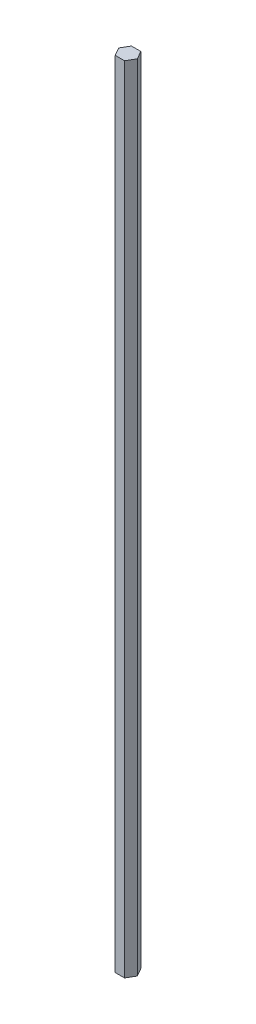
ISO-10303-21;
HEADER;
FILE_DESCRIPTION(('STEP AP214'),'2;1');
FILE_NAME('part.step','',(''),(''),'','','');
FILE_SCHEMA(('AUTOMOTIVE_DESIGN { 1 0 10303 214 1 1 1 1 }'));
ENDSEC;
DATA;
#1=APPLICATION_CONTEXT('core data for automotive mechanical design processes');
#2=APPLICATION_PROTOCOL_DEFINITION('international standard','automotive_design',2000,#1);
#3=PRODUCT_CONTEXT('',#1,'mechanical');
#4=PRODUCT('Part','Part','',(#3));
#5=PRODUCT_RELATED_PRODUCT_CATEGORY('part','',(#4));
#6=PRODUCT_DEFINITION_FORMATION('','',#4);
#7=PRODUCT_DEFINITION_CONTEXT('part definition',#1,'design');
#8=PRODUCT_DEFINITION('design','',#6,#7);
#9=PRODUCT_DEFINITION_SHAPE('','',#8);
#10=(LENGTH_UNIT() NAMED_UNIT(*) SI_UNIT(.MILLI.,.METRE.));
#11=(NAMED_UNIT(*) PLANE_ANGLE_UNIT() SI_UNIT($,.RADIAN.));
#12=(NAMED_UNIT(*) SI_UNIT($,.STERADIAN.) SOLID_ANGLE_UNIT());
#13=UNCERTAINTY_MEASURE_WITH_UNIT(LENGTH_MEASURE(1.E-05),#10,'distance_accuracy_value','');
#14=(GEOMETRIC_REPRESENTATION_CONTEXT(3) GLOBAL_UNCERTAINTY_ASSIGNED_CONTEXT((#13)) GLOBAL_UNIT_ASSIGNED_CONTEXT((#10,
#11,#12)) REPRESENTATION_CONTEXT('',''));
#15=CARTESIAN_POINT('',(0.,0.,0.));
#16=DIRECTION('',(0.,0.,1.));
#17=DIRECTION('',(1.,0.,0.));
#18=AXIS2_PLACEMENT_3D('',#15,#16,#17);
#19=CARTESIAN_POINT('',(-3.66617420935412,622.3,6.35));
#20=DIRECTION('',(0.,0.,-1.));
#21=DIRECTION('',(-1.,0.,0.));
#22=AXIS2_PLACEMENT_3D('',#19,#20,#21);
#23=PLANE('',#22);
#24=DIRECTION('',(1.,0.,0.));
#25=VECTOR('',#24,1.);
#26=CARTESIAN_POINT('',(-3.66617420935412,0.,6.35));
#27=LINE('',#26,#25);
#28=CARTESIAN_POINT('',(-3.66617420935412,0.,6.35));
#29=VERTEX_POINT('',#28);
#30=CARTESIAN_POINT('',(3.66617420935412,0.,6.35));
#31=VERTEX_POINT('',#30);
#32=EDGE_CURVE('E119',#29,#31,#27,.T.);
#33=ORIENTED_EDGE('',*,*,#32,.T.);
#34=DIRECTION('',(0.,-1.,0.));
#35=VECTOR('',#34,1.);
#36=CARTESIAN_POINT('',(3.66617420935412,622.3,6.35));
#37=LINE('',#36,#35);
#38=CARTESIAN_POINT('',(3.66617420935412,622.3,6.35));
#39=VERTEX_POINT('',#38);
#40=EDGE_CURVE('E11',#39,#31,#37,.T.);
#41=ORIENTED_EDGE('',*,*,#40,.F.);
#42=DIRECTION('',(1.,0.,0.));
#43=VECTOR('',#42,1.);
#44=CARTESIAN_POINT('',(-3.66617420935412,622.3,6.35));
#45=LINE('',#44,#43);
#46=CARTESIAN_POINT('',(-3.66617420935412,622.3,6.35));
#47=VERTEX_POINT('',#46);
#48=EDGE_CURVE('E129',#47,#39,#45,.T.);
#49=ORIENTED_EDGE('',*,*,#48,.F.);
#50=DIRECTION('',(0.,-1.,0.));
#51=VECTOR('',#50,1.);
#52=CARTESIAN_POINT('',(-3.66617420935412,622.3,6.35));
#53=LINE('',#52,#51);
#54=EDGE_CURVE('E115',#47,#29,#53,.T.);
#55=ORIENTED_EDGE('',*,*,#54,.T.);
#56=EDGE_LOOP('',(#33,#41,#49,#55));
#57=FACE_BOUND('',#56,.T.);
#58=ADVANCED_FACE('F35',(#57),#23,.F.);
#59=CARTESIAN_POINT('',(3.66617420935412,622.3,6.35));
#60=DIRECTION('',(-0.866025403784438,0.,-0.5));
#61=DIRECTION('',(-0.5,0.,0.866025403784438));
#62=AXIS2_PLACEMENT_3D('',#59,#60,#61);
#63=PLANE('',#62);
#64=DIRECTION('',(0.5,0.,-0.866025403784438));
#65=VECTOR('',#64,1.);
#66=CARTESIAN_POINT('',(3.66617420935412,0.,6.35));
#67=LINE('',#66,#65);
#68=CARTESIAN_POINT('',(7.33234841870825,0.,0.));
#69=VERTEX_POINT('',#68);
#70=EDGE_CURVE('E122',#31,#69,#67,.T.);
#71=ORIENTED_EDGE('',*,*,#70,.T.);
#72=DIRECTION('',(0.,-1.,0.));
#73=VECTOR('',#72,1.);
#74=CARTESIAN_POINT('',(7.33234841870825,622.3,0.));
#75=LINE('',#74,#73);
#76=CARTESIAN_POINT('',(7.33234841870825,622.3,0.));
#77=VERTEX_POINT('',#76);
#78=EDGE_CURVE('E43',#77,#69,#75,.T.);
#79=ORIENTED_EDGE('',*,*,#78,.F.);
#80=DIRECTION('',(0.5,0.,-0.866025403784438));
#81=VECTOR('',#80,1.);
#82=CARTESIAN_POINT('',(3.66617420935412,622.3,6.35));
#83=LINE('',#82,#81);
#84=EDGE_CURVE('E88',#39,#77,#83,.T.);
#85=ORIENTED_EDGE('',*,*,#84,.F.);
#86=ORIENTED_EDGE('',*,*,#40,.T.);
#87=EDGE_LOOP('',(#71,#79,#85,#86));
#88=FACE_BOUND('',#87,.T.);
#89=ADVANCED_FACE('F153',(#88),#63,.F.);
#90=CARTESIAN_POINT('',(7.33234841870825,622.3,0.));
#91=DIRECTION('',(-0.866025403784439,0.,0.5));
#92=DIRECTION('',(0.5,0.,0.866025403784439));
#93=AXIS2_PLACEMENT_3D('',#90,#91,#92);
#94=PLANE('',#93);
#95=DIRECTION('',(-0.5,0.,-0.866025403784439));
#96=VECTOR('',#95,1.);
#97=CARTESIAN_POINT('',(7.33234841870825,0.,0.));
#98=LINE('',#97,#96);
#99=CARTESIAN_POINT('',(3.66617420935413,0.,-6.35));
#100=VERTEX_POINT('',#99);
#101=EDGE_CURVE('E124',#69,#100,#98,.T.);
#102=ORIENTED_EDGE('',*,*,#101,.T.);
#103=DIRECTION('',(0.,-1.,0.));
#104=VECTOR('',#103,1.);
#105=CARTESIAN_POINT('',(3.66617420935413,622.3,-6.35));
#106=LINE('',#105,#104);
#107=CARTESIAN_POINT('',(3.66617420935413,622.3,-6.35));
#108=VERTEX_POINT('',#107);
#109=EDGE_CURVE('E110',#108,#100,#106,.T.);
#110=ORIENTED_EDGE('',*,*,#109,.F.);
#111=DIRECTION('',(-0.5,0.,-0.866025403784439));
#112=VECTOR('',#111,1.);
#113=CARTESIAN_POINT('',(7.33234841870825,622.3,0.));
#114=LINE('',#113,#112);
#115=EDGE_CURVE('E101',#77,#108,#114,.T.);
#116=ORIENTED_EDGE('',*,*,#115,.F.);
#117=ORIENTED_EDGE('',*,*,#78,.T.);
#118=EDGE_LOOP('',(#102,#110,#116,#117));
#119=FACE_BOUND('',#118,.T.);
#120=ADVANCED_FACE('F135',(#119),#94,.F.);
#121=CARTESIAN_POINT('',(3.66617420935413,622.3,-6.35));
#122=DIRECTION('',(0.,0.,1.));
#123=DIRECTION('',(1.,0.,0.));
#124=AXIS2_PLACEMENT_3D('',#121,#122,#123);
#125=PLANE('',#124);
#126=DIRECTION('',(-1.,0.,0.));
#127=VECTOR('',#126,1.);
#128=CARTESIAN_POINT('',(3.66617420935413,0.,-6.35));
#129=LINE('',#128,#127);
#130=CARTESIAN_POINT('',(-3.66617420935412,0.,-6.35));
#131=VERTEX_POINT('',#130);
#132=EDGE_CURVE('E109',#100,#131,#129,.T.);
#133=ORIENTED_EDGE('',*,*,#132,.T.);
#134=DIRECTION('',(0.,-1.,0.));
#135=VECTOR('',#134,1.);
#136=CARTESIAN_POINT('',(-3.66617420935412,622.3,-6.35));
#137=LINE('',#136,#135);
#138=CARTESIAN_POINT('',(-3.66617420935412,622.3,-6.35));
#139=VERTEX_POINT('',#138);
#140=EDGE_CURVE('E106',#139,#131,#137,.T.);
#141=ORIENTED_EDGE('',*,*,#140,.F.);
#142=DIRECTION('',(-1.,0.,0.));
#143=VECTOR('',#142,1.);
#144=CARTESIAN_POINT('',(3.66617420935413,622.3,-6.35));
#145=LINE('',#144,#143);
#146=EDGE_CURVE('E95',#108,#139,#145,.T.);
#147=ORIENTED_EDGE('',*,*,#146,.F.);
#148=ORIENTED_EDGE('',*,*,#109,.T.);
#149=EDGE_LOOP('',(#133,#141,#147,#148));
#150=FACE_BOUND('',#149,.T.);
#151=ADVANCED_FACE('F107',(#150),#125,.F.);
#152=CARTESIAN_POINT('',(-3.66617420935412,622.3,-6.35));
#153=DIRECTION('',(0.866025403784438,0.,0.5));
#154=DIRECTION('',(0.5,0.,-0.866025403784438));
#155=AXIS2_PLACEMENT_3D('',#152,#153,#154);
#156=PLANE('',#155);
#157=DIRECTION('',(-0.5,0.,0.866025403784438));
#158=VECTOR('',#157,1.);
#159=CARTESIAN_POINT('',(-3.66617420935412,0.,-6.35));
#160=LINE('',#159,#158);
#161=CARTESIAN_POINT('',(-7.33234841870825,0.,0.));
#162=VERTEX_POINT('',#161);
#163=EDGE_CURVE('E74',#131,#162,#160,.T.);
#164=ORIENTED_EDGE('',*,*,#163,.T.);
#165=DIRECTION('',(0.,-1.,0.));
#166=VECTOR('',#165,1.);
#167=CARTESIAN_POINT('',(-7.33234841870825,622.3,0.));
#168=LINE('',#167,#166);
#169=CARTESIAN_POINT('',(-7.33234841870825,622.3,0.));
#170=VERTEX_POINT('',#169);
#171=EDGE_CURVE('E111',#170,#162,#168,.T.);
#172=ORIENTED_EDGE('',*,*,#171,.F.);
#173=DIRECTION('',(-0.5,0.,0.866025403784438));
#174=VECTOR('',#173,1.);
#175=CARTESIAN_POINT('',(-3.66617420935412,622.3,-6.35));
#176=LINE('',#175,#174);
#177=EDGE_CURVE('E99',#139,#170,#176,.T.);
#178=ORIENTED_EDGE('',*,*,#177,.F.);
#179=ORIENTED_EDGE('',*,*,#140,.T.);
#180=EDGE_LOOP('',(#164,#172,#178,#179));
#181=FACE_BOUND('',#180,.T.);
#182=ADVANCED_FACE('F113',(#181),#156,.F.);
#183=CARTESIAN_POINT('',(-7.33234841870825,622.3,0.));
#184=DIRECTION('',(0.866025403784439,0.,-0.5));
#185=DIRECTION('',(-0.5,0.,-0.866025403784439));
#186=AXIS2_PLACEMENT_3D('',#183,#184,#185);
#187=PLANE('',#186);
#188=DIRECTION('',(0.5,0.,0.866025403784439));
#189=VECTOR('',#188,1.);
#190=CARTESIAN_POINT('',(-7.33234841870825,0.,0.));
#191=LINE('',#190,#189);
#192=EDGE_CURVE('E80',#162,#29,#191,.T.);
#193=ORIENTED_EDGE('',*,*,#192,.T.);
#194=ORIENTED_EDGE('',*,*,#54,.F.);
#195=DIRECTION('',(0.5,0.,0.866025403784439));
#196=VECTOR('',#195,1.);
#197=CARTESIAN_POINT('',(-7.33234841870825,622.3,0.));
#198=LINE('',#197,#196);
#199=EDGE_CURVE('E51',#170,#47,#198,.T.);
#200=ORIENTED_EDGE('',*,*,#199,.F.);
#201=ORIENTED_EDGE('',*,*,#171,.T.);
#202=EDGE_LOOP('',(#193,#194,#200,#201));
#203=FACE_BOUND('',#202,.T.);
#204=ADVANCED_FACE('F142',(#203),#187,.F.);
#205=CARTESIAN_POINT('',(0.,622.3,0.));
#206=DIRECTION('',(0.,1.,0.));
#207=DIRECTION('',(0.,0.,1.));
#208=AXIS2_PLACEMENT_3D('',#205,#206,#207);
#209=PLANE('',#208);
#210=ORIENTED_EDGE('',*,*,#48,.T.);
#211=ORIENTED_EDGE('',*,*,#84,.T.);
#212=ORIENTED_EDGE('',*,*,#115,.T.);
#213=ORIENTED_EDGE('',*,*,#146,.T.);
#214=ORIENTED_EDGE('',*,*,#177,.T.);
#215=ORIENTED_EDGE('',*,*,#199,.T.);
#216=EDGE_LOOP('',(#210,#211,#212,#213,#214,#215));
#217=FACE_BOUND('',#216,.T.);
#218=ADVANCED_FACE('F97',(#217),#209,.T.);
#219=CARTESIAN_POINT('',(0.,0.,0.));
#220=DIRECTION('',(0.,1.,0.));
#221=DIRECTION('',(0.,0.,1.));
#222=AXIS2_PLACEMENT_3D('',#219,#220,#221);
#223=PLANE('',#222);
#224=ORIENTED_EDGE('',*,*,#32,.F.);
#225=ORIENTED_EDGE('',*,*,#192,.F.);
#226=ORIENTED_EDGE('',*,*,#163,.F.);
#227=ORIENTED_EDGE('',*,*,#132,.F.);
#228=ORIENTED_EDGE('',*,*,#101,.F.);
#229=ORIENTED_EDGE('',*,*,#70,.F.);
#230=EDGE_LOOP('',(#224,#225,#226,#227,#228,#229));
#231=FACE_BOUND('',#230,.T.);
#232=ADVANCED_FACE('F138',(#231),#223,.F.);
#233=CLOSED_SHELL('',(#58,#89,#120,#151,#182,#204,#218,#232));
#234=MANIFOLD_SOLID_BREP('B2',#233);
#235=ADVANCED_BREP_SHAPE_REPRESENTATION('',(#18,#234),#14);
#236=SHAPE_DEFINITION_REPRESENTATION(#9,#235);
ENDSEC;
END-ISO-10303-21;
